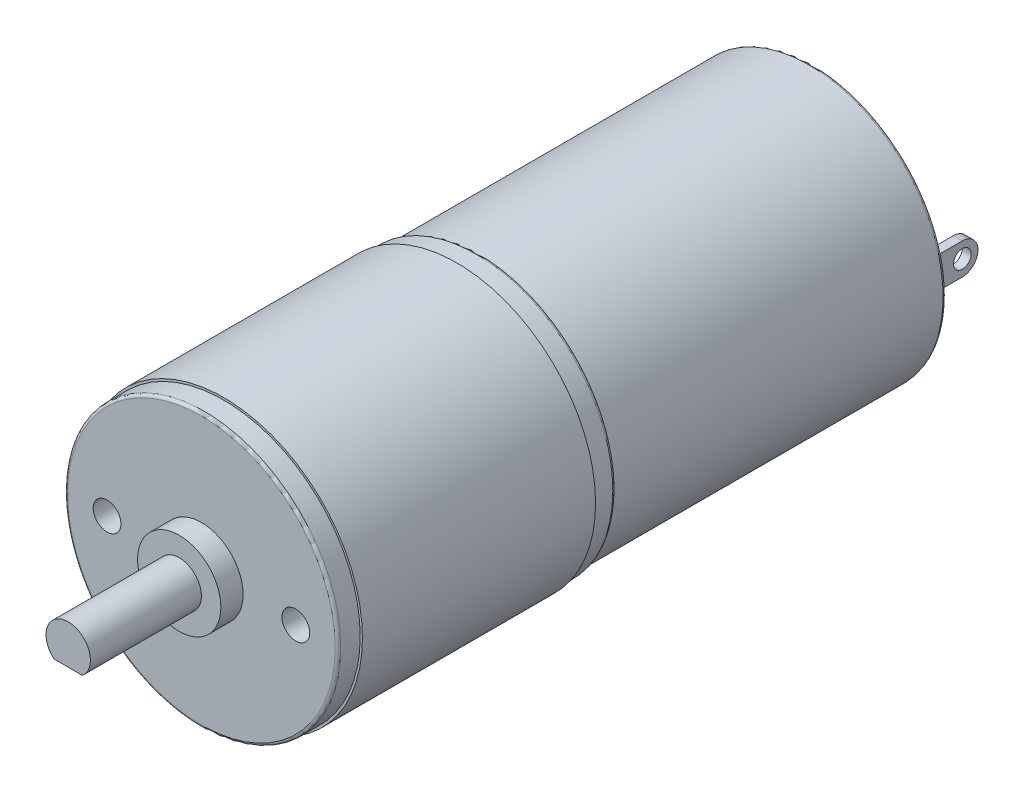
ISO-10303-21;
HEADER;
FILE_DESCRIPTION(('STEP AP214'),'2;1');
FILE_NAME('part.step','',(''),(''),'','','');
FILE_SCHEMA(('AUTOMOTIVE_DESIGN { 1 0 10303 214 1 1 1 1 }'));
ENDSEC;
DATA;
#1=APPLICATION_CONTEXT('core data for automotive mechanical design processes');
#2=APPLICATION_PROTOCOL_DEFINITION('international standard','automotive_design',2000,#1);
#3=PRODUCT_CONTEXT('',#1,'mechanical');
#4=PRODUCT('Part','Part','',(#3));
#5=PRODUCT_RELATED_PRODUCT_CATEGORY('part','',(#4));
#6=PRODUCT_DEFINITION_FORMATION('','',#4);
#7=PRODUCT_DEFINITION_CONTEXT('part definition',#1,'design');
#8=PRODUCT_DEFINITION('design','',#6,#7);
#9=PRODUCT_DEFINITION_SHAPE('','',#8);
#10=(LENGTH_UNIT() NAMED_UNIT(*) SI_UNIT(.MILLI.,.METRE.));
#11=(NAMED_UNIT(*) PLANE_ANGLE_UNIT() SI_UNIT($,.RADIAN.));
#12=(NAMED_UNIT(*) SI_UNIT($,.STERADIAN.) SOLID_ANGLE_UNIT());
#13=UNCERTAINTY_MEASURE_WITH_UNIT(LENGTH_MEASURE(1.E-05),#10,'distance_accuracy_value','');
#14=(GEOMETRIC_REPRESENTATION_CONTEXT(3) GLOBAL_UNCERTAINTY_ASSIGNED_CONTEXT((#13)) GLOBAL_UNIT_ASSIGNED_CONTEXT((#10,
#11,#12)) REPRESENTATION_CONTEXT('',''));
#15=CARTESIAN_POINT('',(0.,0.,0.));
#16=DIRECTION('',(0.,0.,1.));
#17=DIRECTION('',(1.,0.,0.));
#18=AXIS2_PLACEMENT_3D('',#15,#16,#17);
#19=CARTESIAN_POINT('',(0.,0.,4.));
#20=DIRECTION('',(0.,0.,1.));
#21=DIRECTION('',(1.,0.,0.));
#22=AXIS2_PLACEMENT_3D('',#19,#20,#21);
#23=PLANE('',#22);
#24=CARTESIAN_POINT('',(0.,0.,4.));
#25=DIRECTION('',(0.,0.,1.));
#26=DIRECTION('',(1.,0.,0.));
#27=AXIS2_PLACEMENT_3D('',#24,#25,#26);
#28=CIRCLE('',#27,3.75);
#29=CARTESIAN_POINT('',(3.75,0.,4.));
#30=VERTEX_POINT('',#29);
#31=EDGE_CURVE('E129',#30,#30,#28,.T.);
#32=ORIENTED_EDGE('',*,*,#31,.T.);
#33=EDGE_LOOP('',(#32));
#34=FACE_BOUND('',#33,.T.);
#35=DIRECTION('',(0.99996413586324,-0.00846917866641549,0.));
#36=VECTOR('',#35,1.);
#37=CARTESIAN_POINT('',(-1.28827149156567,-1.52982239623401,4.));
#38=LINE('',#37,#36);
#39=CARTESIAN_POINT('',(-1.28827149156567,-1.529822396234,4.));
#40=VERTEX_POINT('',#39);
#41=CARTESIAN_POINT('',(1.26217493483255,-1.55142335739812,4.));
#42=VERTEX_POINT('',#41);
#43=EDGE_CURVE('E123',#40,#42,#38,.T.);
#44=ORIENTED_EDGE('',*,*,#43,.F.);
#45=CARTESIAN_POINT('',(0.,0.,4.));
#46=DIRECTION('',(0.,0.,1.));
#47=DIRECTION('',(1.,0.,0.));
#48=AXIS2_PLACEMENT_3D('',#45,#46,#47);
#49=CIRCLE('',#48,2.);
#50=EDGE_CURVE('E49',#42,#40,#49,.T.);
#51=ORIENTED_EDGE('',*,*,#50,.F.);
#52=EDGE_LOOP('',(#44,#51));
#53=FACE_BOUND('',#52,.T.);
#54=ADVANCED_FACE('F34',(#34,#53),#23,.T.);
#55=CARTESIAN_POINT('',(0.,0.,2.));
#56=DIRECTION('',(0.,0.,1.));
#57=DIRECTION('',(1.,0.,0.));
#58=AXIS2_PLACEMENT_3D('',#55,#56,#57);
#59=PLANE('',#58);
#60=CARTESIAN_POINT('',(8.5,0.,2.));
#61=DIRECTION('',(0.,0.,1.));
#62=DIRECTION('',(1.,0.,0.));
#63=AXIS2_PLACEMENT_3D('',#60,#61,#62);
#64=CIRCLE('',#63,1.25);
#65=CARTESIAN_POINT('',(9.75,0.,2.));
#66=VERTEX_POINT('',#65);
#67=EDGE_CURVE('E348',#66,#66,#64,.T.);
#68=ORIENTED_EDGE('',*,*,#67,.F.);
#69=EDGE_LOOP('',(#68));
#70=FACE_BOUND('',#69,.T.);
#71=CARTESIAN_POINT('',(-8.5,0.,2.));
#72=DIRECTION('',(0.,0.,1.));
#73=DIRECTION('',(1.,0.,0.));
#74=AXIS2_PLACEMENT_3D('',#71,#72,#73);
#75=CIRCLE('',#74,1.25);
#76=CARTESIAN_POINT('',(-7.25,0.,2.));
#77=VERTEX_POINT('',#76);
#78=EDGE_CURVE('E350',#77,#77,#75,.T.);
#79=ORIENTED_EDGE('',*,*,#78,.F.);
#80=EDGE_LOOP('',(#79));
#81=FACE_BOUND('',#80,.T.);
#82=CARTESIAN_POINT('',(0.,0.,2.));
#83=DIRECTION('',(0.,0.,1.));
#84=DIRECTION('',(1.,0.,0.));
#85=AXIS2_PLACEMENT_3D('',#82,#83,#84);
#86=CIRCLE('',#85,12.05);
#87=CARTESIAN_POINT('',(12.05,0.,2.));
#88=VERTEX_POINT('',#87);
#89=EDGE_CURVE('E217',#88,#88,#86,.T.);
#90=ORIENTED_EDGE('',*,*,#89,.T.);
#91=EDGE_LOOP('',(#90));
#92=FACE_BOUND('',#91,.T.);
#93=CARTESIAN_POINT('',(0.,0.,2.));
#94=DIRECTION('',(0.,0.,1.));
#95=DIRECTION('',(1.,0.,0.));
#96=AXIS2_PLACEMENT_3D('',#93,#94,#95);
#97=CIRCLE('',#96,3.75);
#98=CARTESIAN_POINT('',(3.75,0.,2.));
#99=VERTEX_POINT('',#98);
#100=EDGE_CURVE('E126',#99,#99,#97,.T.);
#101=ORIENTED_EDGE('',*,*,#100,.F.);
#102=EDGE_LOOP('',(#101));
#103=FACE_BOUND('',#102,.T.);
#104=ADVANCED_FACE('F271',(#70,#81,#92,#103),#59,.T.);
#105=CARTESIAN_POINT('',(0.,0.,-53.));
#106=DIRECTION('',(0.,0.,-1.));
#107=DIRECTION('',(-1.,0.,0.));
#108=AXIS2_PLACEMENT_3D('',#105,#106,#107);
#109=PLANE('',#108);
#110=DIRECTION('',(0.,-1.,0.));
#111=VECTOR('',#110,1.);
#112=CARTESIAN_POINT('',(-9.28203767483268,1.53859863631757,-53.));
#113=LINE('',#112,#111);
#114=CARTESIAN_POINT('',(-9.28203767483268,1.53859863631757,-53.));
#115=VERTEX_POINT('',#114);
#116=CARTESIAN_POINT('',(-9.28203767483268,-1.28636935167499,-53.));
#117=VERTEX_POINT('',#116);
#118=EDGE_CURVE('E168',#115,#117,#113,.T.);
#119=ORIENTED_EDGE('',*,*,#118,.F.);
#120=DIRECTION('',(1.,0.,0.));
#121=VECTOR('',#120,1.);
#122=CARTESIAN_POINT('',(-10.0891713856877,1.53859863631757,-53.));
#123=LINE('',#122,#121);
#124=CARTESIAN_POINT('',(-10.0891713856877,1.53859863631757,-53.));
#125=VERTEX_POINT('',#124);
#126=EDGE_CURVE('E165',#125,#115,#123,.T.);
#127=ORIENTED_EDGE('',*,*,#126,.F.);
#128=DIRECTION('',(0.,1.,0.));
#129=VECTOR('',#128,1.);
#130=CARTESIAN_POINT('',(-10.0891713856877,1.53859863631757,-53.));
#131=LINE('',#130,#129);
#132=CARTESIAN_POINT('',(-10.0891713856877,-1.28636935167499,-53.));
#133=VERTEX_POINT('',#132);
#134=EDGE_CURVE('E174',#133,#125,#131,.T.);
#135=ORIENTED_EDGE('',*,*,#134,.F.);
#136=DIRECTION('',(-1.,0.,0.));
#137=VECTOR('',#136,1.);
#138=CARTESIAN_POINT('',(-10.0891713856877,-1.28636935167499,-53.));
#139=LINE('',#138,#137);
#140=EDGE_CURVE('E171',#117,#133,#139,.T.);
#141=ORIENTED_EDGE('',*,*,#140,.F.);
#142=EDGE_LOOP('',(#119,#127,#135,#141));
#143=FACE_BOUND('',#142,.T.);
#144=CARTESIAN_POINT('',(0.,0.,-53.));
#145=DIRECTION('',(0.,0.,-1.));
#146=DIRECTION('',(-1.,0.,0.));
#147=AXIS2_PLACEMENT_3D('',#144,#145,#146);
#148=CIRCLE('',#147,11.8);
#149=CARTESIAN_POINT('',(-11.8,0.,-53.));
#150=VERTEX_POINT('',#149);
#151=EDGE_CURVE('E229',#150,#150,#148,.T.);
#152=ORIENTED_EDGE('',*,*,#151,.T.);
#153=EDGE_LOOP('',(#152));
#154=FACE_BOUND('',#153,.T.);
#155=DIRECTION('',(-1.,0.,0.));
#156=VECTOR('',#155,1.);
#157=CARTESIAN_POINT('',(10.0891713856877,-1.28636935167499,-53.));
#158=LINE('',#157,#156);
#159=CARTESIAN_POINT('',(10.0891713856877,-1.28636935167499,-53.));
#160=VERTEX_POINT('',#159);
#161=CARTESIAN_POINT('',(9.28203767483268,-1.28636935167499,-53.));
#162=VERTEX_POINT('',#161);
#163=EDGE_CURVE('E188',#160,#162,#158,.T.);
#164=ORIENTED_EDGE('',*,*,#163,.F.);
#165=DIRECTION('',(0.,-1.,0.));
#166=VECTOR('',#165,1.);
#167=CARTESIAN_POINT('',(10.0891713856877,1.53859863631757,-53.));
#168=LINE('',#167,#166);
#169=CARTESIAN_POINT('',(10.0891713856877,1.53859863631757,-53.));
#170=VERTEX_POINT('',#169);
#171=EDGE_CURVE('E185',#170,#160,#168,.T.);
#172=ORIENTED_EDGE('',*,*,#171,.F.);
#173=DIRECTION('',(1.,0.,0.));
#174=VECTOR('',#173,1.);
#175=CARTESIAN_POINT('',(10.0891713856877,1.53859863631757,-53.));
#176=LINE('',#175,#174);
#177=CARTESIAN_POINT('',(9.28203767483268,1.53859863631757,-53.));
#178=VERTEX_POINT('',#177);
#179=EDGE_CURVE('E194',#178,#170,#176,.T.);
#180=ORIENTED_EDGE('',*,*,#179,.F.);
#181=DIRECTION('',(0.,1.,0.));
#182=VECTOR('',#181,1.);
#183=CARTESIAN_POINT('',(9.28203767483268,1.53859863631757,-53.));
#184=LINE('',#183,#182);
#185=EDGE_CURVE('E191',#162,#178,#184,.T.);
#186=ORIENTED_EDGE('',*,*,#185,.F.);
#187=EDGE_LOOP('',(#164,#172,#180,#186));
#188=FACE_BOUND('',#187,.T.);
#189=CARTESIAN_POINT('',(0.,0.,-53.));
#190=DIRECTION('',(0.,0.,-1.));
#191=DIRECTION('',(-1.,0.,0.));
#192=AXIS2_PLACEMENT_3D('',#189,#190,#191);
#193=CIRCLE('',#192,2.5);
#194=CARTESIAN_POINT('',(-2.5,0.,-53.));
#195=VERTEX_POINT('',#194);
#196=EDGE_CURVE('E135',#195,#195,#193,.T.);
#197=ORIENTED_EDGE('',*,*,#196,.F.);
#198=EDGE_LOOP('',(#197));
#199=FACE_BOUND('',#198,.T.);
#200=ADVANCED_FACE('F267',(#143,#154,#188,#199),#109,.T.);
#201=CARTESIAN_POINT('',(10.0891713856877,-1.28636935167499,-58.));
#202=DIRECTION('',(0.,1.,0.));
#203=DIRECTION('',(0.,0.,1.));
#204=AXIS2_PLACEMENT_3D('',#201,#202,#203);
#205=PLANE('',#204);
#206=DIRECTION('',(1.,0.,0.));
#207=VECTOR('',#206,1.);
#208=CARTESIAN_POINT('',(-12.5,-1.28636935167499,-56.439265274647));
#209=LINE('',#208,#207);
#210=CARTESIAN_POINT('',(9.28203767483268,-1.28636935167499,-56.439265274647));
#211=VERTEX_POINT('',#210);
#212=CARTESIAN_POINT('',(10.0891713856877,-1.28636935167499,-56.439265274647));
#213=VERTEX_POINT('',#212);
#214=EDGE_CURVE('E144',#211,#213,#209,.T.);
#215=ORIENTED_EDGE('',*,*,#214,.T.);
#216=DIRECTION('',(0.,0.,1.));
#217=VECTOR('',#216,1.);
#218=CARTESIAN_POINT('',(10.0891713856877,-1.28636935167499,-58.));
#219=LINE('',#218,#217);
#220=EDGE_CURVE('E203',#213,#160,#219,.T.);
#221=ORIENTED_EDGE('',*,*,#220,.T.);
#222=ORIENTED_EDGE('',*,*,#163,.T.);
#223=DIRECTION('',(0.,0.,1.));
#224=VECTOR('',#223,1.);
#225=CARTESIAN_POINT('',(9.28203767483268,-1.28636935167499,-58.));
#226=LINE('',#225,#224);
#227=EDGE_CURVE('E201',#211,#162,#226,.T.);
#228=ORIENTED_EDGE('',*,*,#227,.F.);
#229=EDGE_LOOP('',(#215,#221,#222,#228));
#230=FACE_BOUND('',#229,.T.);
#231=ADVANCED_FACE('F270',(#230),#205,.F.);
#232=CARTESIAN_POINT('',(-10.0891713856877,-1.28636935167499,-58.));
#233=DIRECTION('',(0.,1.,0.));
#234=DIRECTION('',(0.,0.,1.));
#235=AXIS2_PLACEMENT_3D('',#232,#233,#234);
#236=PLANE('',#235);
#237=CARTESIAN_POINT('',(-10.0891713856877,-1.28636935167499,-56.439265274647));
#238=VERTEX_POINT('',#237);
#239=CARTESIAN_POINT('',(-9.28203767483268,-1.28636935167499,-56.439265274647));
#240=VERTEX_POINT('',#239);
#241=EDGE_CURVE('E148',#238,#240,#209,.T.);
#242=ORIENTED_EDGE('',*,*,#241,.T.);
#243=DIRECTION('',(0.,0.,1.));
#244=VECTOR('',#243,1.);
#245=CARTESIAN_POINT('',(-9.28203767483268,-1.28636935167499,-58.));
#246=LINE('',#245,#244);
#247=EDGE_CURVE('E181',#240,#117,#246,.T.);
#248=ORIENTED_EDGE('',*,*,#247,.T.);
#249=ORIENTED_EDGE('',*,*,#140,.T.);
#250=DIRECTION('',(0.,0.,1.));
#251=VECTOR('',#250,1.);
#252=CARTESIAN_POINT('',(-10.0891713856877,-1.28636935167499,-58.));
#253=LINE('',#252,#251);
#254=EDGE_CURVE('E179',#238,#133,#253,.T.);
#255=ORIENTED_EDGE('',*,*,#254,.F.);
#256=EDGE_LOOP('',(#242,#248,#249,#255));
#257=FACE_BOUND('',#256,.T.);
#258=ADVANCED_FACE('F257',(#257),#236,.F.);
#259=CARTESIAN_POINT('',(0.,0.,-21.));
#260=DIRECTION('',(0.,0.,-1.));
#261=DIRECTION('',(-1.,0.,0.));
#262=AXIS2_PLACEMENT_3D('',#259,#260,#261);
#263=PLANE('',#262);
#264=CARTESIAN_POINT('',(0.,0.,-21.));
#265=DIRECTION('',(0.,0.,-1.));
#266=DIRECTION('',(-1.,0.,0.));
#267=AXIS2_PLACEMENT_3D('',#264,#265,#266);
#268=CIRCLE('',#267,12.5);
#269=CARTESIAN_POINT('',(-12.5,0.,-21.));
#270=VERTEX_POINT('',#269);
#271=EDGE_CURVE('E209',#270,#270,#268,.T.);
#272=ORIENTED_EDGE('',*,*,#271,.T.);
#273=EDGE_LOOP('',(#272));
#274=FACE_BOUND('',#273,.T.);
#275=CARTESIAN_POINT('',(0.,0.,-21.));
#276=DIRECTION('',(0.,0.,-1.));
#277=DIRECTION('',(-1.,0.,0.));
#278=AXIS2_PLACEMENT_3D('',#275,#276,#277);
#279=CIRCLE('',#278,12.3);
#280=CARTESIAN_POINT('',(-12.3,0.,-21.));
#281=VERTEX_POINT('',#280);
#282=EDGE_CURVE('E205',#281,#281,#279,.T.);
#283=ORIENTED_EDGE('',*,*,#282,.F.);
#284=EDGE_LOOP('',(#283));
#285=FACE_BOUND('',#284,.T.);
#286=ADVANCED_FACE('F378',(#274,#285),#263,.T.);
#287=CARTESIAN_POINT('',(0.,0.,2.));
#288=DIRECTION('',(0.,0.,-1.));
#289=DIRECTION('',(-1.,0.,0.));
#290=AXIS2_PLACEMENT_3D('',#287,#288,#289);
#291=CYLINDRICAL_SURFACE('',#290,12.3);
#292=CARTESIAN_POINT('',(0.,0.,1.75));
#293=DIRECTION('',(0.,0.,1.));
#294=DIRECTION('',(1.,0.,0.));
#295=AXIS2_PLACEMENT_3D('',#292,#293,#294);
#296=CIRCLE('',#295,12.3);
#297=CARTESIAN_POINT('',(12.3,0.,1.75));
#298=VERTEX_POINT('',#297);
#299=EDGE_CURVE('E220',#298,#298,#296,.F.);
#300=ORIENTED_EDGE('',*,*,#299,.T.);
#301=EDGE_LOOP('',(#300));
#302=FACE_BOUND('',#301,.T.);
#303=CARTESIAN_POINT('',(0.,0.,0.));
#304=DIRECTION('',(0.,0.,-1.));
#305=DIRECTION('',(-1.,0.,0.));
#306=AXIS2_PLACEMENT_3D('',#303,#304,#305);
#307=CIRCLE('',#306,12.3);
#308=CARTESIAN_POINT('',(-12.3,0.,0.));
#309=VERTEX_POINT('',#308);
#310=EDGE_CURVE('E212',#309,#309,#307,.T.);
#311=ORIENTED_EDGE('',*,*,#310,.F.);
#312=EDGE_LOOP('',(#311));
#313=FACE_BOUND('',#312,.T.);
#314=ADVANCED_FACE('F368',(#302,#313),#291,.T.);
#315=CARTESIAN_POINT('',(0.,0.,1.75));
#316=DIRECTION('',(0.,0.,1.));
#317=DIRECTION('',(1.,0.,0.));
#318=AXIS2_PLACEMENT_3D('',#315,#316,#317);
#319=TOROIDAL_SURFACE('',#318,12.05,0.25);
#320=ORIENTED_EDGE('',*,*,#299,.F.);
#321=EDGE_LOOP('',(#320));
#322=FACE_BOUND('',#321,.T.);
#323=ORIENTED_EDGE('',*,*,#89,.F.);
#324=EDGE_LOOP('',(#323));
#325=FACE_BOUND('',#324,.T.);
#326=ADVANCED_FACE('F365',(#322,#325),#319,.T.);
#327=CARTESIAN_POINT('',(0.,0.,0.));
#328=DIRECTION('',(0.,0.,-1.));
#329=DIRECTION('',(-1.,0.,0.));
#330=AXIS2_PLACEMENT_3D('',#327,#328,#329);
#331=PLANE('',#330);
#332=CARTESIAN_POINT('',(0.,0.,0.));
#333=DIRECTION('',(0.,0.,-1.));
#334=DIRECTION('',(-1.,0.,0.));
#335=AXIS2_PLACEMENT_3D('',#332,#333,#334);
#336=CIRCLE('',#335,12.5);
#337=CARTESIAN_POINT('',(-12.5,0.,0.));
#338=VERTEX_POINT('',#337);
#339=EDGE_CURVE('E208',#338,#338,#336,.T.);
#340=ORIENTED_EDGE('',*,*,#339,.F.);
#341=EDGE_LOOP('',(#340));
#342=FACE_BOUND('',#341,.T.);
#343=ORIENTED_EDGE('',*,*,#310,.T.);
#344=EDGE_LOOP('',(#343));
#345=FACE_BOUND('',#344,.T.);
#346=ADVANCED_FACE('F367',(#342,#345),#331,.F.);
#347=CARTESIAN_POINT('',(0.,0.,-21.));
#348=DIRECTION('',(0.,0.,1.));
#349=DIRECTION('',(1.,0.,0.));
#350=AXIS2_PLACEMENT_3D('',#347,#348,#349);
#351=CYLINDRICAL_SURFACE('',#350,12.5);
#352=ORIENTED_EDGE('',*,*,#271,.F.);
#353=EDGE_LOOP('',(#352));
#354=FACE_BOUND('',#353,.T.);
#355=ORIENTED_EDGE('',*,*,#339,.T.);
#356=EDGE_LOOP('',(#355));
#357=FACE_BOUND('',#356,.T.);
#358=ADVANCED_FACE('F375',(#354,#357),#351,.T.);
#359=CARTESIAN_POINT('',(0.,0.,-23.));
#360=DIRECTION('',(0.,0.,1.));
#361=DIRECTION('',(1.,0.,0.));
#362=AXIS2_PLACEMENT_3D('',#359,#360,#361);
#363=CYLINDRICAL_SURFACE('',#362,12.3);
#364=CARTESIAN_POINT('',(0.,0.,-22.75));
#365=DIRECTION('',(0.,0.,-1.));
#366=DIRECTION('',(-1.,0.,0.));
#367=AXIS2_PLACEMENT_3D('',#364,#365,#366);
#368=CIRCLE('',#367,12.3);
#369=CARTESIAN_POINT('',(-12.3,0.,-22.75));
#370=VERTEX_POINT('',#369);
#371=EDGE_CURVE('E226',#370,#370,#368,.F.);
#372=ORIENTED_EDGE('',*,*,#371,.T.);
#373=EDGE_LOOP('',(#372));
#374=FACE_BOUND('',#373,.T.);
#375=ORIENTED_EDGE('',*,*,#282,.T.);
#376=EDGE_LOOP('',(#375));
#377=FACE_BOUND('',#376,.T.);
#378=ADVANCED_FACE('F385',(#374,#377),#363,.T.);
#379=CARTESIAN_POINT('',(0.,0.,-22.75));
#380=DIRECTION('',(0.,0.,-1.));
#381=DIRECTION('',(-1.,0.,0.));
#382=AXIS2_PLACEMENT_3D('',#379,#380,#381);
#383=TOROIDAL_SURFACE('',#382,12.05,0.25);
#384=ORIENTED_EDGE('',*,*,#371,.F.);
#385=EDGE_LOOP('',(#384));
#386=FACE_BOUND('',#385,.T.);
#387=CARTESIAN_POINT('',(0.,0.,-23.));
#388=DIRECTION('',(0.,0.,-1.));
#389=DIRECTION('',(-1.,0.,0.));
#390=AXIS2_PLACEMENT_3D('',#387,#388,#389);
#391=CIRCLE('',#390,12.05);
#392=CARTESIAN_POINT('',(-12.05,0.,-23.));
#393=VERTEX_POINT('',#392);
#394=EDGE_CURVE('E223',#393,#393,#391,.T.);
#395=ORIENTED_EDGE('',*,*,#394,.F.);
#396=EDGE_LOOP('',(#395));
#397=FACE_BOUND('',#396,.T.);
#398=ADVANCED_FACE('F382',(#386,#397),#383,.T.);
#399=CARTESIAN_POINT('',(0.,0.,-53.));
#400=DIRECTION('',(0.,0.,1.));
#401=DIRECTION('',(1.,0.,0.));
#402=AXIS2_PLACEMENT_3D('',#399,#400,#401);
#403=CYLINDRICAL_SURFACE('',#402,12.05);
#404=CARTESIAN_POINT('',(0.,0.,-52.75));
#405=DIRECTION('',(0.,0.,-1.));
#406=DIRECTION('',(-1.,0.,0.));
#407=AXIS2_PLACEMENT_3D('',#404,#405,#406);
#408=CIRCLE('',#407,12.05);
#409=CARTESIAN_POINT('',(-12.05,0.,-52.75));
#410=VERTEX_POINT('',#409);
#411=EDGE_CURVE('E42',#410,#410,#408,.F.);
#412=ORIENTED_EDGE('',*,*,#411,.T.);
#413=EDGE_LOOP('',(#412));
#414=FACE_BOUND('',#413,.T.);
#415=ORIENTED_EDGE('',*,*,#394,.T.);
#416=EDGE_LOOP('',(#415));
#417=FACE_BOUND('',#416,.T.);
#418=ADVANCED_FACE('F384',(#414,#417),#403,.T.);
#419=CARTESIAN_POINT('',(0.,0.,-52.75));
#420=DIRECTION('',(0.,0.,-1.));
#421=DIRECTION('',(-1.,0.,0.));
#422=AXIS2_PLACEMENT_3D('',#419,#420,#421);
#423=TOROIDAL_SURFACE('',#422,11.8,0.25);
#424=ORIENTED_EDGE('',*,*,#411,.F.);
#425=EDGE_LOOP('',(#424));
#426=FACE_BOUND('',#425,.T.);
#427=ORIENTED_EDGE('',*,*,#151,.F.);
#428=EDGE_LOOP('',(#427));
#429=FACE_BOUND('',#428,.T.);
#430=ADVANCED_FACE('F36',(#426,#429),#423,.T.);
#431=CARTESIAN_POINT('',(10.0891713856877,1.53859863631757,-58.));
#432=DIRECTION('',(-1.,0.,0.));
#433=DIRECTION('',(0.,0.,1.));
#434=AXIS2_PLACEMENT_3D('',#431,#432,#433);
#435=PLANE('',#434);
#436=CARTESIAN_POINT('',(10.0891713856877,0.126114642321288,-56.439265274647));
#437=DIRECTION('',(1.,0.,0.));
#438=DIRECTION('',(0.,0.,-1.));
#439=AXIS2_PLACEMENT_3D('',#436,#437,#438);
#440=CIRCLE('',#439,0.800000000000003);
#441=CARTESIAN_POINT('',(10.0891713856877,0.126114642321288,-57.239265274647));
#442=VERTEX_POINT('',#441);
#443=EDGE_CURVE('E155',#442,#442,#440,.T.);
#444=ORIENTED_EDGE('',*,*,#443,.F.);
#445=EDGE_LOOP('',(#444));
#446=FACE_BOUND('',#445,.T.);
#447=ORIENTED_EDGE('',*,*,#220,.F.);
#448=CARTESIAN_POINT('',(10.0891713856877,0.126114642321288,-56.439265274647));
#449=DIRECTION('',(-1.,0.,0.));
#450=DIRECTION('',(0.,0.,1.));
#451=AXIS2_PLACEMENT_3D('',#448,#449,#450);
#452=CIRCLE('',#451,1.41248399399628);
#453=CARTESIAN_POINT('',(10.0891713856877,1.53859863631757,-56.439265274647));
#454=VERTEX_POINT('',#453);
#455=EDGE_CURVE('E140',#454,#213,#452,.T.);
#456=ORIENTED_EDGE('',*,*,#455,.F.);
#457=DIRECTION('',(0.,0.,1.));
#458=VECTOR('',#457,1.);
#459=CARTESIAN_POINT('',(10.0891713856877,1.53859863631757,-58.));
#460=LINE('',#459,#458);
#461=EDGE_CURVE('E197',#454,#170,#460,.T.);
#462=ORIENTED_EDGE('',*,*,#461,.T.);
#463=ORIENTED_EDGE('',*,*,#171,.T.);
#464=EDGE_LOOP('',(#447,#456,#462,#463));
#465=FACE_BOUND('',#464,.T.);
#466=ADVANCED_FACE('F447',(#446,#465),#435,.F.);
#467=CARTESIAN_POINT('',(9.28203767483268,1.53859863631757,-58.));
#468=DIRECTION('',(1.,0.,0.));
#469=DIRECTION('',(0.,0.,-1.));
#470=AXIS2_PLACEMENT_3D('',#467,#468,#469);
#471=PLANE('',#470);
#472=CARTESIAN_POINT('',(9.28203767483268,0.126114642321288,-56.439265274647));
#473=DIRECTION('',(1.,0.,0.));
#474=DIRECTION('',(0.,0.,-1.));
#475=AXIS2_PLACEMENT_3D('',#472,#473,#474);
#476=CIRCLE('',#475,0.800000000000003);
#477=CARTESIAN_POINT('',(9.28203767483268,0.126114642321288,-57.239265274647));
#478=VERTEX_POINT('',#477);
#479=EDGE_CURVE('E162',#478,#478,#476,.T.);
#480=ORIENTED_EDGE('',*,*,#479,.T.);
#481=EDGE_LOOP('',(#480));
#482=FACE_BOUND('',#481,.T.);
#483=DIRECTION('',(0.,0.,1.));
#484=VECTOR('',#483,1.);
#485=CARTESIAN_POINT('',(9.28203767483268,1.53859863631757,-58.));
#486=LINE('',#485,#484);
#487=CARTESIAN_POINT('',(9.28203767483268,1.53859863631757,-56.439265274647));
#488=VERTEX_POINT('',#487);
#489=EDGE_CURVE('E199',#488,#178,#486,.T.);
#490=ORIENTED_EDGE('',*,*,#489,.F.);
#491=CARTESIAN_POINT('',(9.28203767483268,0.126114642321288,-56.439265274647));
#492=DIRECTION('',(1.,0.,0.));
#493=DIRECTION('',(0.,0.,-1.));
#494=AXIS2_PLACEMENT_3D('',#491,#492,#493);
#495=CIRCLE('',#494,1.41248399399628);
#496=EDGE_CURVE('E57',#488,#211,#495,.F.);
#497=ORIENTED_EDGE('',*,*,#496,.T.);
#498=ORIENTED_EDGE('',*,*,#227,.T.);
#499=ORIENTED_EDGE('',*,*,#185,.T.);
#500=EDGE_LOOP('',(#490,#497,#498,#499));
#501=FACE_BOUND('',#500,.T.);
#502=ADVANCED_FACE('F473',(#482,#501),#471,.F.);
#503=CARTESIAN_POINT('',(10.0891713856877,1.53859863631757,-58.));
#504=DIRECTION('',(0.,-1.,0.));
#505=DIRECTION('',(0.,0.,-1.));
#506=AXIS2_PLACEMENT_3D('',#503,#504,#505);
#507=PLANE('',#506);
#508=ORIENTED_EDGE('',*,*,#461,.F.);
#509=DIRECTION('',(1.,0.,0.));
#510=VECTOR('',#509,1.);
#511=CARTESIAN_POINT('',(-12.5,1.53859863631757,-56.439265274647));
#512=LINE('',#511,#510);
#513=EDGE_CURVE('E145',#488,#454,#512,.T.);
#514=ORIENTED_EDGE('',*,*,#513,.F.);
#515=ORIENTED_EDGE('',*,*,#489,.T.);
#516=ORIENTED_EDGE('',*,*,#179,.T.);
#517=EDGE_LOOP('',(#508,#514,#515,#516));
#518=FACE_BOUND('',#517,.T.);
#519=ADVANCED_FACE('F483',(#518),#507,.F.);
#520=CARTESIAN_POINT('',(-10.0891713856877,1.53859863631757,-58.));
#521=DIRECTION('',(0.,-1.,0.));
#522=DIRECTION('',(0.,0.,-1.));
#523=AXIS2_PLACEMENT_3D('',#520,#521,#522);
#524=PLANE('',#523);
#525=DIRECTION('',(0.,0.,1.));
#526=VECTOR('',#525,1.);
#527=CARTESIAN_POINT('',(-9.28203767483268,1.53859863631757,-58.));
#528=LINE('',#527,#526);
#529=CARTESIAN_POINT('',(-9.28203767483268,1.53859863631757,-56.439265274647));
#530=VERTEX_POINT('',#529);
#531=EDGE_CURVE('E183',#530,#115,#528,.T.);
#532=ORIENTED_EDGE('',*,*,#531,.F.);
#533=CARTESIAN_POINT('',(-10.0891713856877,1.53859863631757,-56.439265274647));
#534=VERTEX_POINT('',#533);
#535=EDGE_CURVE('E147',#534,#530,#512,.T.);
#536=ORIENTED_EDGE('',*,*,#535,.F.);
#537=DIRECTION('',(0.,0.,1.));
#538=VECTOR('',#537,1.);
#539=CARTESIAN_POINT('',(-10.0891713856877,1.53859863631757,-58.));
#540=LINE('',#539,#538);
#541=EDGE_CURVE('E177',#534,#125,#540,.T.);
#542=ORIENTED_EDGE('',*,*,#541,.T.);
#543=ORIENTED_EDGE('',*,*,#126,.T.);
#544=EDGE_LOOP('',(#532,#536,#542,#543));
#545=FACE_BOUND('',#544,.T.);
#546=ADVANCED_FACE('F249',(#545),#524,.F.);
#547=CARTESIAN_POINT('',(-9.28203767483268,1.53859863631757,-58.));
#548=DIRECTION('',(-1.,0.,0.));
#549=DIRECTION('',(0.,0.,1.));
#550=AXIS2_PLACEMENT_3D('',#547,#548,#549);
#551=PLANE('',#550);
#552=CARTESIAN_POINT('',(-9.28203767483268,0.126114642321288,-56.439265274647));
#553=DIRECTION('',(-1.,0.,0.));
#554=DIRECTION('',(0.,0.,1.));
#555=AXIS2_PLACEMENT_3D('',#552,#553,#554);
#556=CIRCLE('',#555,0.800000000000003);
#557=CARTESIAN_POINT('',(-9.28203767483268,0.126114642321288,-55.639265274647));
#558=VERTEX_POINT('',#557);
#559=EDGE_CURVE('E159',#558,#558,#556,.T.);
#560=ORIENTED_EDGE('',*,*,#559,.T.);
#561=EDGE_LOOP('',(#560));
#562=FACE_BOUND('',#561,.T.);
#563=ORIENTED_EDGE('',*,*,#247,.F.);
#564=CARTESIAN_POINT('',(-9.28203767483268,0.126114642321288,-56.439265274647));
#565=DIRECTION('',(-1.,0.,0.));
#566=DIRECTION('',(0.,0.,1.));
#567=AXIS2_PLACEMENT_3D('',#564,#565,#566);
#568=CIRCLE('',#567,1.41248399399628);
#569=EDGE_CURVE('E151',#240,#530,#568,.F.);
#570=ORIENTED_EDGE('',*,*,#569,.T.);
#571=ORIENTED_EDGE('',*,*,#531,.T.);
#572=ORIENTED_EDGE('',*,*,#118,.T.);
#573=EDGE_LOOP('',(#563,#570,#571,#572));
#574=FACE_BOUND('',#573,.T.);
#575=ADVANCED_FACE('F246',(#562,#574),#551,.F.);
#576=CARTESIAN_POINT('',(-10.0891713856877,1.53859863631757,-58.));
#577=DIRECTION('',(1.,0.,0.));
#578=DIRECTION('',(0.,0.,-1.));
#579=AXIS2_PLACEMENT_3D('',#576,#577,#578);
#580=PLANE('',#579);
#581=CARTESIAN_POINT('',(-10.0891713856877,0.126114642321288,-56.439265274647));
#582=DIRECTION('',(1.,0.,0.));
#583=DIRECTION('',(0.,0.,-1.));
#584=AXIS2_PLACEMENT_3D('',#581,#582,#583);
#585=CIRCLE('',#584,0.800000000000003);
#586=CARTESIAN_POINT('',(-10.0891713856877,0.126114642321288,-57.239265274647));
#587=VERTEX_POINT('',#586);
#588=EDGE_CURVE('E158',#587,#587,#585,.T.);
#589=ORIENTED_EDGE('',*,*,#588,.T.);
#590=EDGE_LOOP('',(#589));
#591=FACE_BOUND('',#590,.T.);
#592=ORIENTED_EDGE('',*,*,#541,.F.);
#593=CARTESIAN_POINT('',(-10.0891713856877,0.126114642321288,-56.439265274647));
#594=DIRECTION('',(1.,0.,0.));
#595=DIRECTION('',(0.,0.,-1.));
#596=AXIS2_PLACEMENT_3D('',#593,#594,#595);
#597=CIRCLE('',#596,1.41248399399628);
#598=EDGE_CURVE('E11',#534,#238,#597,.F.);
#599=ORIENTED_EDGE('',*,*,#598,.T.);
#600=ORIENTED_EDGE('',*,*,#254,.T.);
#601=ORIENTED_EDGE('',*,*,#134,.T.);
#602=EDGE_LOOP('',(#592,#599,#600,#601));
#603=FACE_BOUND('',#602,.T.);
#604=ADVANCED_FACE('F236',(#591,#603),#580,.F.);
#605=CARTESIAN_POINT('',(-12.5,0.126114642321288,-56.439265274647));
#606=DIRECTION('',(1.,0.,0.));
#607=DIRECTION('',(0.,0.,-1.));
#608=AXIS2_PLACEMENT_3D('',#605,#606,#607);
#609=CYLINDRICAL_SURFACE('',#608,0.800000000000003);
#610=ORIENTED_EDGE('',*,*,#588,.F.);
#611=EDGE_LOOP('',(#610));
#612=FACE_BOUND('',#611,.T.);
#613=ORIENTED_EDGE('',*,*,#559,.F.);
#614=EDGE_LOOP('',(#613));
#615=FACE_BOUND('',#614,.T.);
#616=ADVANCED_FACE('F239',(#612,#615),#609,.F.);
#617=ORIENTED_EDGE('',*,*,#443,.T.);
#618=EDGE_LOOP('',(#617));
#619=FACE_BOUND('',#618,.T.);
#620=ORIENTED_EDGE('',*,*,#479,.F.);
#621=EDGE_LOOP('',(#620));
#622=FACE_BOUND('',#621,.T.);
#623=ADVANCED_FACE('F242',(#619,#622),#609,.F.);
#624=CARTESIAN_POINT('',(-12.5,0.126114642321288,-56.439265274647));
#625=DIRECTION('',(1.,0.,0.));
#626=DIRECTION('',(0.,0.,-1.));
#627=AXIS2_PLACEMENT_3D('',#624,#625,#626);
#628=CYLINDRICAL_SURFACE('',#627,1.41248399399628);
#629=ORIENTED_EDGE('',*,*,#241,.F.);
#630=ORIENTED_EDGE('',*,*,#598,.F.);
#631=ORIENTED_EDGE('',*,*,#535,.T.);
#632=ORIENTED_EDGE('',*,*,#569,.F.);
#633=EDGE_LOOP('',(#629,#630,#631,#632));
#634=FACE_BOUND('',#633,.T.);
#635=ADVANCED_FACE('F261',(#634),#628,.T.);
#636=ORIENTED_EDGE('',*,*,#513,.T.);
#637=ORIENTED_EDGE('',*,*,#455,.T.);
#638=ORIENTED_EDGE('',*,*,#214,.F.);
#639=ORIENTED_EDGE('',*,*,#496,.F.);
#640=EDGE_LOOP('',(#636,#637,#638,#639));
#641=FACE_BOUND('',#640,.T.);
#642=ADVANCED_FACE('F284',(#641),#628,.T.);
#643=CARTESIAN_POINT('',(0.,0.,-53.5));
#644=DIRECTION('',(0.,0.,1.));
#645=DIRECTION('',(1.,0.,0.));
#646=AXIS2_PLACEMENT_3D('',#643,#644,#645);
#647=CYLINDRICAL_SURFACE('',#646,2.5);
#648=CARTESIAN_POINT('',(0.,0.,-53.5));
#649=DIRECTION('',(0.,0.,-1.));
#650=DIRECTION('',(-1.,0.,0.));
#651=AXIS2_PLACEMENT_3D('',#648,#649,#650);
#652=CIRCLE('',#651,2.5);
#653=CARTESIAN_POINT('',(-2.5,0.,-53.5));
#654=VERTEX_POINT('',#653);
#655=EDGE_CURVE('E137',#654,#654,#652,.T.);
#656=ORIENTED_EDGE('',*,*,#655,.F.);
#657=EDGE_LOOP('',(#656));
#658=FACE_BOUND('',#657,.T.);
#659=ORIENTED_EDGE('',*,*,#196,.T.);
#660=EDGE_LOOP('',(#659));
#661=FACE_BOUND('',#660,.T.);
#662=ADVANCED_FACE('F281',(#658,#661),#647,.T.);
#663=CARTESIAN_POINT('',(0.,0.,-53.5));
#664=DIRECTION('',(0.,0.,-1.));
#665=DIRECTION('',(-1.,0.,0.));
#666=AXIS2_PLACEMENT_3D('',#663,#664,#665);
#667=PLANE('',#666);
#668=ORIENTED_EDGE('',*,*,#655,.T.);
#669=EDGE_LOOP('',(#668));
#670=FACE_BOUND('',#669,.T.);
#671=ADVANCED_FACE('F283',(#670),#667,.T.);
#672=CARTESIAN_POINT('',(0.,0.,4.));
#673=DIRECTION('',(0.,0.,-1.));
#674=DIRECTION('',(-1.,0.,0.));
#675=AXIS2_PLACEMENT_3D('',#672,#673,#674);
#676=CYLINDRICAL_SURFACE('',#675,3.75);
#677=ORIENTED_EDGE('',*,*,#31,.F.);
#678=EDGE_LOOP('',(#677));
#679=FACE_BOUND('',#678,.T.);
#680=ORIENTED_EDGE('',*,*,#100,.T.);
#681=EDGE_LOOP('',(#680));
#682=FACE_BOUND('',#681,.T.);
#683=ADVANCED_FACE('F291',(#679,#682),#676,.T.);
#684=CARTESIAN_POINT('',(0.,0.,14.));
#685=DIRECTION('',(0.,0.,-1.));
#686=DIRECTION('',(-1.,0.,0.));
#687=AXIS2_PLACEMENT_3D('',#684,#685,#686);
#688=CYLINDRICAL_SURFACE('',#687,2.);
#689=ORIENTED_EDGE('',*,*,#50,.T.);
#690=DIRECTION('',(0.,0.,-1.));
#691=VECTOR('',#690,1.);
#692=CARTESIAN_POINT('',(-1.28827149156567,-1.52982239623401,14.));
#693=LINE('',#692,#691);
#694=CARTESIAN_POINT('',(-1.28827149156567,-1.52982239623401,14.));
#695=VERTEX_POINT('',#694);
#696=EDGE_CURVE('E115',#695,#40,#693,.T.);
#697=ORIENTED_EDGE('',*,*,#696,.F.);
#698=CARTESIAN_POINT('',(0.,0.,14.));
#699=DIRECTION('',(0.,0.,1.));
#700=DIRECTION('',(1.,0.,0.));
#701=AXIS2_PLACEMENT_3D('',#698,#699,#700);
#702=CIRCLE('',#701,2.);
#703=CARTESIAN_POINT('',(1.26217493483255,-1.55142335739812,14.));
#704=VERTEX_POINT('',#703);
#705=EDGE_CURVE('E120',#704,#695,#702,.T.);
#706=ORIENTED_EDGE('',*,*,#705,.F.);
#707=DIRECTION('',(0.,0.,-1.));
#708=VECTOR('',#707,1.);
#709=CARTESIAN_POINT('',(1.26217493483255,-1.55142335739812,14.));
#710=LINE('',#709,#708);
#711=EDGE_CURVE('E117',#704,#42,#710,.T.);
#712=ORIENTED_EDGE('',*,*,#711,.T.);
#713=EDGE_LOOP('',(#689,#697,#706,#712));
#714=FACE_BOUND('',#713,.T.);
#715=ADVANCED_FACE('F125',(#714),#688,.T.);
#716=CARTESIAN_POINT('',(-1.28827149156567,-1.52982239623401,14.));
#717=DIRECTION('',(0.00846917866641549,0.99996413586324,0.));
#718=DIRECTION('',(-0.99996413586324,0.00846917866641549,0.));
#719=AXIS2_PLACEMENT_3D('',#716,#717,#718);
#720=PLANE('',#719);
#721=ORIENTED_EDGE('',*,*,#43,.T.);
#722=ORIENTED_EDGE('',*,*,#711,.F.);
#723=DIRECTION('',(0.99996413586324,-0.00846917866641549,0.));
#724=VECTOR('',#723,1.);
#725=CARTESIAN_POINT('',(-1.28827149156567,-1.52982239623401,14.));
#726=LINE('',#725,#724);
#727=EDGE_CURVE('E112',#695,#704,#726,.T.);
#728=ORIENTED_EDGE('',*,*,#727,.F.);
#729=ORIENTED_EDGE('',*,*,#696,.T.);
#730=EDGE_LOOP('',(#721,#722,#728,#729));
#731=FACE_BOUND('',#730,.T.);
#732=ADVANCED_FACE('F114',(#731),#720,.F.);
#733=CARTESIAN_POINT('',(0.,0.,14.));
#734=DIRECTION('',(0.,0.,1.));
#735=DIRECTION('',(1.,0.,0.));
#736=AXIS2_PLACEMENT_3D('',#733,#734,#735);
#737=PLANE('',#736);
#738=ORIENTED_EDGE('',*,*,#705,.T.);
#739=ORIENTED_EDGE('',*,*,#727,.T.);
#740=EDGE_LOOP('',(#738,#739));
#741=FACE_BOUND('',#740,.T.);
#742=ADVANCED_FACE('F122',(#741),#737,.T.);
#743=CARTESIAN_POINT('',(-8.5,0.,-8.));
#744=DIRECTION('',(0.,0.,-1.));
#745=DIRECTION('',(-1.,0.,0.));
#746=AXIS2_PLACEMENT_3D('',#743,#744,#745);
#747=PLANE('',#746);
#748=CARTESIAN_POINT('',(-8.5,0.,-8.));
#749=DIRECTION('',(0.,0.,1.));
#750=DIRECTION('',(1.,0.,0.));
#751=AXIS2_PLACEMENT_3D('',#748,#749,#750);
#752=CIRCLE('',#751,1.25);
#753=CARTESIAN_POINT('',(-7.25,0.,-8.));
#754=VERTEX_POINT('',#753);
#755=EDGE_CURVE('E355',#754,#754,#752,.T.);
#756=ORIENTED_EDGE('',*,*,#755,.T.);
#757=EDGE_LOOP('',(#756));
#758=FACE_BOUND('',#757,.T.);
#759=ADVANCED_FACE('F323',(#758),#747,.F.);
#760=CARTESIAN_POINT('',(-8.5,0.,2.));
#761=DIRECTION('',(0.,0.,1.));
#762=DIRECTION('',(1.,0.,0.));
#763=AXIS2_PLACEMENT_3D('',#760,#761,#762);
#764=CYLINDRICAL_SURFACE('',#763,1.25);
#765=ORIENTED_EDGE('',*,*,#755,.F.);
#766=EDGE_LOOP('',(#765));
#767=FACE_BOUND('',#766,.T.);
#768=ORIENTED_EDGE('',*,*,#78,.T.);
#769=EDGE_LOOP('',(#768));
#770=FACE_BOUND('',#769,.T.);
#771=ADVANCED_FACE('F328',(#767,#770),#764,.F.);
#772=CARTESIAN_POINT('',(8.5,0.,-8.));
#773=DIRECTION('',(0.,0.,-1.));
#774=DIRECTION('',(-1.,0.,0.));
#775=AXIS2_PLACEMENT_3D('',#772,#773,#774);
#776=PLANE('',#775);
#777=CARTESIAN_POINT('',(8.5,0.,-8.));
#778=DIRECTION('',(0.,0.,1.));
#779=DIRECTION('',(1.,0.,0.));
#780=AXIS2_PLACEMENT_3D('',#777,#778,#779);
#781=CIRCLE('',#780,1.25);
#782=CARTESIAN_POINT('',(9.75,0.,-8.));
#783=VERTEX_POINT('',#782);
#784=EDGE_CURVE('E345',#783,#783,#781,.T.);
#785=ORIENTED_EDGE('',*,*,#784,.T.);
#786=EDGE_LOOP('',(#785));
#787=FACE_BOUND('',#786,.T.);
#788=ADVANCED_FACE('F332',(#787),#776,.F.);
#789=CARTESIAN_POINT('',(8.5,0.,2.));
#790=DIRECTION('',(0.,0.,1.));
#791=DIRECTION('',(1.,0.,0.));
#792=AXIS2_PLACEMENT_3D('',#789,#790,#791);
#793=CYLINDRICAL_SURFACE('',#792,1.25);
#794=ORIENTED_EDGE('',*,*,#784,.F.);
#795=EDGE_LOOP('',(#794));
#796=FACE_BOUND('',#795,.T.);
#797=ORIENTED_EDGE('',*,*,#67,.T.);
#798=EDGE_LOOP('',(#797));
#799=FACE_BOUND('',#798,.T.);
#800=ADVANCED_FACE('F336',(#796,#799),#793,.F.);
#801=CLOSED_SHELL('',(#54,#104,#200,#231,#258,#286,#314,#326,#346,#358,#378,#398,#418,#430,#466,
#502,#519,#546,#575,#604,#616,#623,#635,#642,#662,#671,#683,#715,#732,#742,#759,#771,#788,#800));
#802=MANIFOLD_SOLID_BREP('B2',#801);
#803=ADVANCED_BREP_SHAPE_REPRESENTATION('',(#18,#802),#14);
#804=SHAPE_DEFINITION_REPRESENTATION(#9,#803);
ENDSEC;
END-ISO-10303-21;
